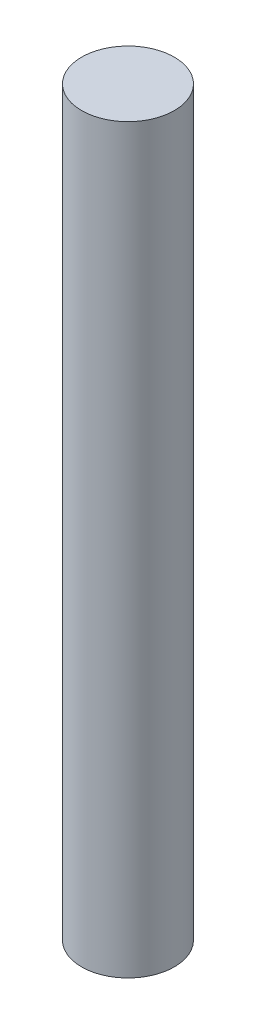
ISO-10303-21;
HEADER;
FILE_DESCRIPTION(('STEP AP214'),'2;1');
FILE_NAME('part.step','',(''),(''),'','','');
FILE_SCHEMA(('AUTOMOTIVE_DESIGN { 1 0 10303 214 1 1 1 1 }'));
ENDSEC;
DATA;
#1=APPLICATION_CONTEXT('core data for automotive mechanical design processes');
#2=APPLICATION_PROTOCOL_DEFINITION('international standard','automotive_design',2000,#1);
#3=PRODUCT_CONTEXT('',#1,'mechanical');
#4=PRODUCT('Part','Part','',(#3));
#5=PRODUCT_RELATED_PRODUCT_CATEGORY('part','',(#4));
#6=PRODUCT_DEFINITION_FORMATION('','',#4);
#7=PRODUCT_DEFINITION_CONTEXT('part definition',#1,'design');
#8=PRODUCT_DEFINITION('design','',#6,#7);
#9=PRODUCT_DEFINITION_SHAPE('','',#8);
#10=(LENGTH_UNIT() NAMED_UNIT(*) SI_UNIT(.MILLI.,.METRE.));
#11=(NAMED_UNIT(*) PLANE_ANGLE_UNIT() SI_UNIT($,.RADIAN.));
#12=(NAMED_UNIT(*) SI_UNIT($,.STERADIAN.) SOLID_ANGLE_UNIT());
#13=UNCERTAINTY_MEASURE_WITH_UNIT(LENGTH_MEASURE(1.E-05),#10,'distance_accuracy_value','');
#14=(GEOMETRIC_REPRESENTATION_CONTEXT(3) GLOBAL_UNCERTAINTY_ASSIGNED_CONTEXT((#13)) GLOBAL_UNIT_ASSIGNED_CONTEXT((#10,
#11,#12)) REPRESENTATION_CONTEXT('',''));
#15=CARTESIAN_POINT('',(0.,0.,0.));
#16=DIRECTION('',(0.,0.,1.));
#17=DIRECTION('',(1.,0.,0.));
#18=AXIS2_PLACEMENT_3D('',#15,#16,#17);
#19=CARTESIAN_POINT('',(0.,152.4,0.));
#20=DIRECTION('',(0.,-1.,0.));
#21=DIRECTION('',(0.,0.,-1.));
#22=AXIS2_PLACEMENT_3D('',#19,#20,#21);
#23=CYLINDRICAL_SURFACE('',#22,9.525);
#24=CARTESIAN_POINT('',(0.,152.4,0.));
#25=DIRECTION('',(0.,1.,0.));
#26=DIRECTION('',(0.,0.,1.));
#27=AXIS2_PLACEMENT_3D('',#24,#25,#26);
#28=CIRCLE('',#27,9.525);
#29=CARTESIAN_POINT('',(0.,152.4,9.525));
#30=VERTEX_POINT('',#29);
#31=EDGE_CURVE('E10',#30,#30,#28,.T.);
#32=ORIENTED_EDGE('',*,*,#31,.F.);
#33=EDGE_LOOP('',(#32));
#34=FACE_BOUND('',#33,.T.);
#35=CARTESIAN_POINT('',(0.,0.,0.));
#36=DIRECTION('',(0.,1.,0.));
#37=DIRECTION('',(0.,0.,1.));
#38=AXIS2_PLACEMENT_3D('',#35,#36,#37);
#39=CIRCLE('',#38,9.525);
#40=CARTESIAN_POINT('',(0.,0.,9.525));
#41=VERTEX_POINT('',#40);
#42=EDGE_CURVE('E36',#41,#41,#39,.T.);
#43=ORIENTED_EDGE('',*,*,#42,.T.);
#44=EDGE_LOOP('',(#43));
#45=FACE_BOUND('',#44,.T.);
#46=ADVANCED_FACE('F33',(#34,#45),#23,.T.);
#47=CARTESIAN_POINT('',(0.,152.4,0.));
#48=DIRECTION('',(0.,1.,0.));
#49=DIRECTION('',(0.,0.,1.));
#50=AXIS2_PLACEMENT_3D('',#47,#48,#49);
#51=PLANE('',#50);
#52=ORIENTED_EDGE('',*,*,#31,.T.);
#53=EDGE_LOOP('',(#52));
#54=FACE_BOUND('',#53,.T.);
#55=ADVANCED_FACE('F48',(#54),#51,.T.);
#56=CARTESIAN_POINT('',(0.,0.,0.));
#57=DIRECTION('',(0.,1.,0.));
#58=DIRECTION('',(0.,0.,1.));
#59=AXIS2_PLACEMENT_3D('',#56,#57,#58);
#60=PLANE('',#59);
#61=ORIENTED_EDGE('',*,*,#42,.F.);
#62=EDGE_LOOP('',(#61));
#63=FACE_BOUND('',#62,.T.);
#64=ADVANCED_FACE('F46',(#63),#60,.F.);
#65=CLOSED_SHELL('',(#46,#55,#64));
#66=MANIFOLD_SOLID_BREP('B2',#65);
#67=ADVANCED_BREP_SHAPE_REPRESENTATION('',(#18,#66),#14);
#68=SHAPE_DEFINITION_REPRESENTATION(#9,#67);
ENDSEC;
END-ISO-10303-21;
